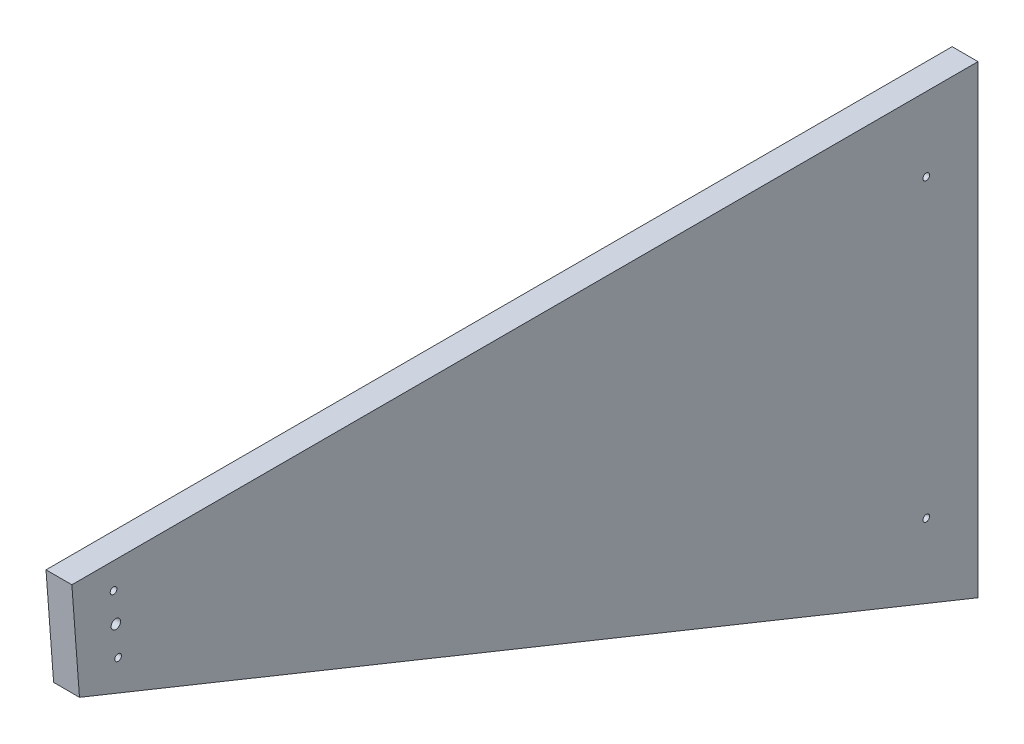
ISO-10303-21;
HEADER;
FILE_DESCRIPTION(('STEP AP214'),'2;1');
FILE_NAME('part.step','',(''),(''),'','','');
FILE_SCHEMA(('AUTOMOTIVE_DESIGN { 1 0 10303 214 1 1 1 1 }'));
ENDSEC;
DATA;
#1=APPLICATION_CONTEXT('core data for automotive mechanical design processes');
#2=APPLICATION_PROTOCOL_DEFINITION('international standard','automotive_design',2000,#1);
#3=PRODUCT_CONTEXT('',#1,'mechanical');
#4=PRODUCT('Part','Part','',(#3));
#5=PRODUCT_RELATED_PRODUCT_CATEGORY('part','',(#4));
#6=PRODUCT_DEFINITION_FORMATION('','',#4);
#7=PRODUCT_DEFINITION_CONTEXT('part definition',#1,'design');
#8=PRODUCT_DEFINITION('design','',#6,#7);
#9=PRODUCT_DEFINITION_SHAPE('','',#8);
#10=(LENGTH_UNIT() NAMED_UNIT(*) SI_UNIT(.MILLI.,.METRE.));
#11=(NAMED_UNIT(*) PLANE_ANGLE_UNIT() SI_UNIT($,.RADIAN.));
#12=(NAMED_UNIT(*) SI_UNIT($,.STERADIAN.) SOLID_ANGLE_UNIT());
#13=UNCERTAINTY_MEASURE_WITH_UNIT(LENGTH_MEASURE(1.E-05),#10,'distance_accuracy_value','');
#14=(GEOMETRIC_REPRESENTATION_CONTEXT(3) GLOBAL_UNCERTAINTY_ASSIGNED_CONTEXT((#13)) GLOBAL_UNIT_ASSIGNED_CONTEXT((#10,
#11,#12)) REPRESENTATION_CONTEXT('',''));
#15=CARTESIAN_POINT('',(0.,0.,0.));
#16=DIRECTION('',(0.,0.,1.));
#17=DIRECTION('',(1.,0.,0.));
#18=AXIS2_PLACEMENT_3D('',#15,#16,#17);
#19=CARTESIAN_POINT('',(285.75,6812.73593849404,3017.19500052054));
#20=DIRECTION('',(1.,-1.19356260075187E-13,0.));
#21=DIRECTION('',(1.19356260075187E-13,1.,0.));
#22=AXIS2_PLACEMENT_3D('',#19,#20,#21);
#23=PLANE('',#22);
#24=CARTESIAN_POINT('',(285.750000000057,6964.61767983907,3320.17307254985));
#25=DIRECTION('',(-1.,0.,0.));
#26=DIRECTION('',(0.,0.,1.));
#27=AXIS2_PLACEMENT_3D('',#24,#25,#26);
#28=CIRCLE('',#27,2.45744999999964);
#29=CARTESIAN_POINT('',(285.750000000057,6964.61767983907,3322.63052254985));
#30=VERTEX_POINT('',#29);
#31=EDGE_CURVE('E147',#30,#30,#28,.T.);
#32=ORIENTED_EDGE('',*,*,#31,.T.);
#33=EDGE_LOOP('',(#32));
#34=FACE_BOUND('',#33,.T.);
#35=CARTESIAN_POINT('',(285.750000000053,6920.29230044106,3316.84692745016));
#36=DIRECTION('',(-1.,0.,0.));
#37=DIRECTION('',(0.,0.,1.));
#38=AXIS2_PLACEMENT_3D('',#35,#36,#37);
#39=CIRCLE('',#38,2.45744999999964);
#40=CARTESIAN_POINT('',(285.750000000052,6920.29230044106,3319.30437745015));
#41=VERTEX_POINT('',#40);
#42=EDGE_CURVE('E138',#41,#41,#39,.T.);
#43=ORIENTED_EDGE('',*,*,#42,.T.);
#44=EDGE_LOOP('',(#43));
#45=FACE_BOUND('',#44,.T.);
#46=CARTESIAN_POINT('',(285.750000000023,6929.29753945556,2721.6100000542));
#47=DIRECTION('',(1.,-1.19356260075187E-13,0.));
#48=DIRECTION('',(1.19356260075187E-13,1.,0.));
#49=AXIS2_PLACEMENT_3D('',#46,#47,#48);
#50=CIRCLE('',#49,2.45744999999964);
#51=CARTESIAN_POINT('',(285.750000000023,6931.75498945556,2721.6100000542));
#52=VERTEX_POINT('',#51);
#53=EDGE_CURVE('E129',#52,#52,#50,.T.);
#54=ORIENTED_EDGE('',*,*,#53,.F.);
#55=EDGE_LOOP('',(#54));
#56=FACE_BOUND('',#55,.T.);
#57=CARTESIAN_POINT('',(285.749999999997,6711.56773671743,2721.6100000542));
#58=DIRECTION('',(1.,-1.19356260075187E-13,0.));
#59=DIRECTION('',(1.19356260075187E-13,1.,0.));
#60=AXIS2_PLACEMENT_3D('',#57,#58,#59);
#61=CIRCLE('',#60,2.45744999999964);
#62=CARTESIAN_POINT('',(285.749999999997,6714.02518671743,2721.6100000542));
#63=VERTEX_POINT('',#62);
#64=EDGE_CURVE('E95',#63,#63,#61,.T.);
#65=ORIENTED_EDGE('',*,*,#64,.F.);
#66=EDGE_LOOP('',(#65));
#67=FACE_BOUND('',#66,.T.);
#68=CARTESIAN_POINT('',(285.750000000008,6942.45499014005,3318.51));
#69=DIRECTION('',(-1.,1.19356260075173E-13,0.));
#70=DIRECTION('',(-1.19356260075173E-13,-1.,0.));
#71=AXIS2_PLACEMENT_3D('',#68,#69,#70);
#72=CIRCLE('',#71,3.49249999999985);
#73=CARTESIAN_POINT('',(285.750000000008,6938.96249014005,3318.51));
#74=VERTEX_POINT('',#73);
#75=EDGE_CURVE('E47',#74,#74,#72,.T.);
#76=ORIENTED_EDGE('',*,*,#75,.T.);
#77=EDGE_LOOP('',(#76));
#78=FACE_BOUND('',#77,.T.);
#79=DIRECTION('',(0.,1.,0.));
#80=VECTOR('',#79,1.);
#81=CARTESIAN_POINT('',(285.750000000038,6641.741886848,2683.51));
#82=LINE('',#81,#80);
#83=CARTESIAN_POINT('',(285.750000000022,6983.72999014007,2683.51));
#84=VERTEX_POINT('',#83);
#85=CARTESIAN_POINT('',(285.750000000017,6641.741886848,2683.51));
#86=VERTEX_POINT('',#85);
#87=EDGE_CURVE('E97',#84,#86,#82,.F.);
#88=ORIENTED_EDGE('',*,*,#87,.F.);
#89=DIRECTION('',(0.,0.,1.));
#90=VECTOR('',#89,1.);
#91=CARTESIAN_POINT('',(285.75000000001,6983.72999014007,2683.51));
#92=LINE('',#91,#90);
#93=CARTESIAN_POINT('',(285.750000000006,6983.72999014005,3350.88000104103));
#94=VERTEX_POINT('',#93);
#95=EDGE_CURVE('E81',#94,#84,#92,.F.);
#96=ORIENTED_EDGE('',*,*,#95,.F.);
#97=DIRECTION('',(0.,-0.997196386906744,-0.0748289111248876));
#98=VECTOR('',#97,1.);
#99=CARTESIAN_POINT('',(285.750000000003,6983.72999014005,3350.88000104107));
#100=LINE('',#99,#98);
#101=CARTESIAN_POINT('',(285.750000000002,6909.11469486814,3345.28092209157));
#102=VERTEX_POINT('',#101);
#103=EDGE_CURVE('E86',#102,#94,#100,.F.);
#104=ORIENTED_EDGE('',*,*,#103,.F.);
#105=DIRECTION('',(0.,-0.37460659341596,-0.927183854566768));
#106=VECTOR('',#105,1.);
#107=CARTESIAN_POINT('',(285.750000000003,6909.11469486814,3345.28092209158));
#108=LINE('',#107,#106);
#109=EDGE_CURVE('E110',#86,#102,#108,.F.);
#110=ORIENTED_EDGE('',*,*,#109,.F.);
#111=EDGE_LOOP('',(#88,#96,#104,#110));
#112=FACE_BOUND('',#111,.T.);
#113=ADVANCED_FACE('F44',(#34,#45,#56,#67,#78,#112),#23,.T.);
#114=CARTESIAN_POINT('',(266.70000000001,6983.72999014005,3350.88000104107));
#115=DIRECTION('',(0.,-0.0748289111248876,0.997196386906744));
#116=DIRECTION('',(0.,-0.997196386906744,-0.0748289111248876));
#117=AXIS2_PLACEMENT_3D('',#114,#115,#116);
#118=PLANE('',#117);
#119=ORIENTED_EDGE('',*,*,#103,.T.);
#120=DIRECTION('',(-1.,1.19356260075187E-13,0.));
#121=VECTOR('',#120,1.);
#122=CARTESIAN_POINT('',(266.700000000038,6983.72999014007,3350.880001041));
#123=LINE('',#122,#121);
#124=CARTESIAN_POINT('',(266.700000000017,6983.72999014006,3350.88000104103));
#125=VERTEX_POINT('',#124);
#126=EDGE_CURVE('E88',#125,#94,#123,.F.);
#127=ORIENTED_EDGE('',*,*,#126,.F.);
#128=DIRECTION('',(0.,0.997196386906838,0.074828911123633));
#129=VECTOR('',#128,1.);
#130=CARTESIAN_POINT('',(266.700000000001,6909.11469486815,3345.28092209158));
#131=LINE('',#130,#129);
#132=CARTESIAN_POINT('',(266.700000000006,6909.11469486815,3345.28092209157));
#133=VERTEX_POINT('',#132);
#134=EDGE_CURVE('E113',#133,#125,#131,.T.);
#135=ORIENTED_EDGE('',*,*,#134,.F.);
#136=DIRECTION('',(1.,-1.12970962324406E-13,0.));
#137=VECTOR('',#136,1.);
#138=CARTESIAN_POINT('',(266.700000000002,6909.11469486815,3345.28092209158));
#139=LINE('',#138,#137);
#140=EDGE_CURVE('E91',#102,#133,#139,.F.);
#141=ORIENTED_EDGE('',*,*,#140,.F.);
#142=EDGE_LOOP('',(#119,#127,#135,#141));
#143=FACE_BOUND('',#142,.T.);
#144=ADVANCED_FACE('F87',(#143),#118,.T.);
#145=CARTESIAN_POINT('',(266.700000000038,6983.72999014007,2683.51));
#146=DIRECTION('',(1.19356260075187E-13,1.,0.));
#147=DIRECTION('',(-1.,1.19356260075187E-13,0.));
#148=AXIS2_PLACEMENT_3D('',#145,#146,#147);
#149=PLANE('',#148);
#150=ORIENTED_EDGE('',*,*,#95,.T.);
#151=DIRECTION('',(-1.,0.,0.));
#152=VECTOR('',#151,1.);
#153=CARTESIAN_POINT('',(266.700000000002,6983.72999014007,2683.51));
#154=LINE('',#153,#152);
#155=CARTESIAN_POINT('',(266.700000000029,6983.72999014007,2683.51));
#156=VERTEX_POINT('',#155);
#157=EDGE_CURVE('E99',#156,#84,#154,.F.);
#158=ORIENTED_EDGE('',*,*,#157,.F.);
#159=DIRECTION('',(0.,0.,1.));
#160=VECTOR('',#159,1.);
#161=CARTESIAN_POINT('',(266.700000000023,6983.72999014007,3017.19500052054));
#162=LINE('',#161,#160);
#163=EDGE_CURVE('E103',#125,#156,#162,.F.);
#164=ORIENTED_EDGE('',*,*,#163,.F.);
#165=ORIENTED_EDGE('',*,*,#126,.T.);
#166=EDGE_LOOP('',(#150,#158,#164,#165));
#167=FACE_BOUND('',#166,.T.);
#168=ADVANCED_FACE('F101',(#167),#149,.T.);
#169=CARTESIAN_POINT('',(266.700000000002,6641.741886848,2683.51));
#170=DIRECTION('',(0.,0.,-1.));
#171=DIRECTION('',(-1.,0.,0.));
#172=AXIS2_PLACEMENT_3D('',#169,#170,#171);
#173=PLANE('',#172);
#174=ORIENTED_EDGE('',*,*,#87,.T.);
#175=DIRECTION('',(1.,-1.12970962324406E-13,0.));
#176=VECTOR('',#175,1.);
#177=CARTESIAN_POINT('',(266.700000000002,6641.74188684799,2683.51));
#178=LINE('',#177,#176);
#179=CARTESIAN_POINT('',(266.700000000002,6641.741886848,2683.51));
#180=VERTEX_POINT('',#179);
#181=EDGE_CURVE('E61',#180,#86,#178,.T.);
#182=ORIENTED_EDGE('',*,*,#181,.F.);
#183=DIRECTION('',(-1.03707897588097E-13,-1.,0.));
#184=VECTOR('',#183,1.);
#185=CARTESIAN_POINT('',(266.700000000019,6812.73593849404,2683.51));
#186=LINE('',#185,#184);
#187=EDGE_CURVE('E116',#156,#180,#186,.T.);
#188=ORIENTED_EDGE('',*,*,#187,.F.);
#189=ORIENTED_EDGE('',*,*,#157,.T.);
#190=EDGE_LOOP('',(#174,#182,#188,#189));
#191=FACE_BOUND('',#190,.T.);
#192=ADVANCED_FACE('F173',(#191),#173,.T.);
#193=CARTESIAN_POINT('',(266.700000000002,6909.11469486815,3345.28092209158));
#194=DIRECTION('',(-1.21843107780595E-13,-0.927183854566768,0.37460659341596));
#195=DIRECTION('',(0.,-0.37460659341596,-0.927183854566768));
#196=AXIS2_PLACEMENT_3D('',#193,#194,#195);
#197=PLANE('',#196);
#198=ORIENTED_EDGE('',*,*,#109,.T.);
#199=ORIENTED_EDGE('',*,*,#140,.T.);
#200=DIRECTION('',(0.,0.374606593415949,0.927183854566772));
#201=VECTOR('',#200,1.);
#202=CARTESIAN_POINT('',(266.700000000001,6641.741886848,2683.51));
#203=LINE('',#202,#201);
#204=EDGE_CURVE('E53',#180,#133,#203,.T.);
#205=ORIENTED_EDGE('',*,*,#204,.F.);
#206=ORIENTED_EDGE('',*,*,#181,.T.);
#207=EDGE_LOOP('',(#198,#199,#205,#206));
#208=FACE_BOUND('',#207,.T.);
#209=ADVANCED_FACE('F175',(#208),#197,.T.);
#210=CARTESIAN_POINT('',(285.750000000008,6942.45499014005,3318.51));
#211=DIRECTION('',(-1.,1.19356260075173E-13,0.));
#212=DIRECTION('',(-1.19356260075173E-13,-1.,0.));
#213=AXIS2_PLACEMENT_3D('',#210,#211,#212);
#214=CYLINDRICAL_SURFACE('',#213,3.49249999999985);
#215=ORIENTED_EDGE('',*,*,#75,.F.);
#216=EDGE_LOOP('',(#215));
#217=FACE_BOUND('',#216,.T.);
#218=CARTESIAN_POINT('',(266.700000000013,6942.45499014005,3318.51));
#219=DIRECTION('',(-1.,1.19356260075173E-13,0.));
#220=DIRECTION('',(-1.19356260075173E-13,-1.,0.));
#221=AXIS2_PLACEMENT_3D('',#218,#219,#220);
#222=CIRCLE('',#221,3.49249999999985);
#223=CARTESIAN_POINT('',(266.700000000013,6938.96249014005,3318.51));
#224=VERTEX_POINT('',#223);
#225=EDGE_CURVE('E11',#224,#224,#222,.F.);
#226=ORIENTED_EDGE('',*,*,#225,.F.);
#227=EDGE_LOOP('',(#226));
#228=FACE_BOUND('',#227,.T.);
#229=ADVANCED_FACE('F163',(#217,#228),#214,.F.);
#230=CARTESIAN_POINT('',(266.700000000005,6812.73593849404,3017.19500052054));
#231=DIRECTION('',(-1.,1.03707897588097E-13,0.));
#232=DIRECTION('',(-1.03707897588097E-13,-1.,0.));
#233=AXIS2_PLACEMENT_3D('',#230,#231,#232);
#234=PLANE('',#233);
#235=CARTESIAN_POINT('',(266.700000000008,6964.61767983907,3320.17307254984));
#236=DIRECTION('',(-1.,0.,0.));
#237=DIRECTION('',(0.,0.,1.));
#238=AXIS2_PLACEMENT_3D('',#235,#236,#237);
#239=CIRCLE('',#238,4.21639999999979);
#240=CARTESIAN_POINT('',(266.700000000008,6964.61767983907,3324.38947254984));
#241=VERTEX_POINT('',#240);
#242=EDGE_CURVE('E153',#241,#241,#239,.T.);
#243=ORIENTED_EDGE('',*,*,#242,.F.);
#244=EDGE_LOOP('',(#243));
#245=FACE_BOUND('',#244,.T.);
#246=CARTESIAN_POINT('',(266.700000000004,6920.29230044106,3316.84692745015));
#247=DIRECTION('',(-1.,0.,0.));
#248=DIRECTION('',(0.,0.,1.));
#249=AXIS2_PLACEMENT_3D('',#246,#247,#248);
#250=CIRCLE('',#249,4.21639999999979);
#251=CARTESIAN_POINT('',(266.700000000004,6920.29230044106,3321.06332745015));
#252=VERTEX_POINT('',#251);
#253=EDGE_CURVE('E144',#252,#252,#250,.T.);
#254=ORIENTED_EDGE('',*,*,#253,.F.);
#255=EDGE_LOOP('',(#254));
#256=FACE_BOUND('',#255,.T.);
#257=CARTESIAN_POINT('',(266.70000000003,6929.29753945556,2721.6100000542));
#258=DIRECTION('',(-1.,0.,0.));
#259=DIRECTION('',(0.,0.,1.));
#260=AXIS2_PLACEMENT_3D('',#257,#258,#259);
#261=CIRCLE('',#260,4.21639999999979);
#262=CARTESIAN_POINT('',(266.700000000029,6929.29753945556,2725.8264000542));
#263=VERTEX_POINT('',#262);
#264=EDGE_CURVE('E135',#263,#263,#261,.T.);
#265=ORIENTED_EDGE('',*,*,#264,.F.);
#266=EDGE_LOOP('',(#265));
#267=FACE_BOUND('',#266,.T.);
#268=CARTESIAN_POINT('',(266.700000000007,6711.56773671743,2721.6100000542));
#269=DIRECTION('',(-1.,0.,0.));
#270=DIRECTION('',(0.,0.,1.));
#271=AXIS2_PLACEMENT_3D('',#268,#269,#270);
#272=CIRCLE('',#271,4.21639999999979);
#273=CARTESIAN_POINT('',(266.700000000007,6711.56773671743,2725.8264000542));
#274=VERTEX_POINT('',#273);
#275=EDGE_CURVE('E126',#274,#274,#272,.T.);
#276=ORIENTED_EDGE('',*,*,#275,.F.);
#277=EDGE_LOOP('',(#276));
#278=FACE_BOUND('',#277,.T.);
#279=ORIENTED_EDGE('',*,*,#225,.T.);
#280=EDGE_LOOP('',(#279));
#281=FACE_BOUND('',#280,.T.);
#282=ORIENTED_EDGE('',*,*,#187,.T.);
#283=ORIENTED_EDGE('',*,*,#204,.T.);
#284=ORIENTED_EDGE('',*,*,#134,.T.);
#285=ORIENTED_EDGE('',*,*,#163,.T.);
#286=EDGE_LOOP('',(#282,#283,#284,#285));
#287=FACE_BOUND('',#286,.T.);
#288=ADVANCED_FACE('F159',(#245,#256,#267,#278,#281,#287),#234,.T.);
#289=CARTESIAN_POINT('',(266.700000000007,6711.56773671743,2721.6100000542));
#290=DIRECTION('',(-1.,0.,0.));
#291=DIRECTION('',(0.,0.,1.));
#292=AXIS2_PLACEMENT_3D('',#289,#290,#291);
#293=CYLINDRICAL_SURFACE('',#292,2.45744999999964);
#294=CARTESIAN_POINT('',(268.175934296266,6711.56773671743,2721.6100000542));
#295=DIRECTION('',(-1.,0.,0.));
#296=DIRECTION('',(0.,0.,1.));
#297=AXIS2_PLACEMENT_3D('',#294,#295,#296);
#298=CIRCLE('',#297,2.45744999999964);
#299=CARTESIAN_POINT('',(268.175934296266,6711.56773671743,2724.0674500542));
#300=VERTEX_POINT('',#299);
#301=EDGE_CURVE('E123',#300,#300,#298,.T.);
#302=ORIENTED_EDGE('',*,*,#301,.T.);
#303=EDGE_LOOP('',(#302));
#304=FACE_BOUND('',#303,.T.);
#305=ORIENTED_EDGE('',*,*,#64,.T.);
#306=EDGE_LOOP('',(#305));
#307=FACE_BOUND('',#306,.T.);
#308=ADVANCED_FACE('F162',(#304,#307),#293,.F.);
#309=CARTESIAN_POINT('',(266.700000000007,6711.56773671743,2721.6100000542));
#310=DIRECTION('',(-1.,0.,0.));
#311=DIRECTION('',(0.,0.,1.));
#312=AXIS2_PLACEMENT_3D('',#309,#310,#311);
#313=CONICAL_SURFACE('',#312,4.21639999999979,0.872664625997215);
#314=ORIENTED_EDGE('',*,*,#301,.F.);
#315=EDGE_LOOP('',(#314));
#316=FACE_BOUND('',#315,.T.);
#317=ORIENTED_EDGE('',*,*,#275,.T.);
#318=EDGE_LOOP('',(#317));
#319=FACE_BOUND('',#318,.T.);
#320=ADVANCED_FACE('F196',(#316,#319),#313,.F.);
#321=CARTESIAN_POINT('',(266.70000000003,6929.29753945556,2721.6100000542));
#322=DIRECTION('',(-1.,0.,0.));
#323=DIRECTION('',(0.,0.,1.));
#324=AXIS2_PLACEMENT_3D('',#321,#322,#323);
#325=CYLINDRICAL_SURFACE('',#324,2.45744999999964);
#326=CARTESIAN_POINT('',(268.175934296289,6929.29753945556,2721.6100000542));
#327=DIRECTION('',(-1.,0.,0.));
#328=DIRECTION('',(0.,0.,1.));
#329=AXIS2_PLACEMENT_3D('',#326,#327,#328);
#330=CIRCLE('',#329,2.45744999999964);
#331=CARTESIAN_POINT('',(268.175934296289,6929.29753945556,2724.0674500542));
#332=VERTEX_POINT('',#331);
#333=EDGE_CURVE('E132',#332,#332,#330,.T.);
#334=ORIENTED_EDGE('',*,*,#333,.T.);
#335=EDGE_LOOP('',(#334));
#336=FACE_BOUND('',#335,.T.);
#337=ORIENTED_EDGE('',*,*,#53,.T.);
#338=EDGE_LOOP('',(#337));
#339=FACE_BOUND('',#338,.T.);
#340=ADVANCED_FACE('F202',(#336,#339),#325,.F.);
#341=CARTESIAN_POINT('',(266.70000000003,6929.29753945556,2721.6100000542));
#342=DIRECTION('',(-1.,0.,0.));
#343=DIRECTION('',(0.,0.,1.));
#344=AXIS2_PLACEMENT_3D('',#341,#342,#343);
#345=CONICAL_SURFACE('',#344,4.21639999999979,0.872664625997215);
#346=ORIENTED_EDGE('',*,*,#333,.F.);
#347=EDGE_LOOP('',(#346));
#348=FACE_BOUND('',#347,.T.);
#349=ORIENTED_EDGE('',*,*,#264,.T.);
#350=EDGE_LOOP('',(#349));
#351=FACE_BOUND('',#350,.T.);
#352=ADVANCED_FACE('F209',(#348,#351),#345,.F.);
#353=CARTESIAN_POINT('',(266.700000000004,6920.29230044106,3316.84692745015));
#354=DIRECTION('',(-1.,0.,0.));
#355=DIRECTION('',(0.,0.,1.));
#356=AXIS2_PLACEMENT_3D('',#353,#354,#355);
#357=CYLINDRICAL_SURFACE('',#356,2.45744999999964);
#358=ORIENTED_EDGE('',*,*,#42,.F.);
#359=EDGE_LOOP('',(#358));
#360=FACE_BOUND('',#359,.T.);
#361=CARTESIAN_POINT('',(268.175934296263,6920.29230044106,3316.84692745015));
#362=DIRECTION('',(-1.,0.,0.));
#363=DIRECTION('',(0.,0.,1.));
#364=AXIS2_PLACEMENT_3D('',#361,#362,#363);
#365=CIRCLE('',#364,2.45744999999964);
#366=CARTESIAN_POINT('',(268.175934296263,6920.29230044106,3319.30437745015));
#367=VERTEX_POINT('',#366);
#368=EDGE_CURVE('E141',#367,#367,#365,.T.);
#369=ORIENTED_EDGE('',*,*,#368,.T.);
#370=EDGE_LOOP('',(#369));
#371=FACE_BOUND('',#370,.T.);
#372=ADVANCED_FACE('F213',(#360,#371),#357,.F.);
#373=CARTESIAN_POINT('',(266.700000000004,6920.29230044106,3316.84692745015));
#374=DIRECTION('',(-1.,0.,0.));
#375=DIRECTION('',(0.,0.,1.));
#376=AXIS2_PLACEMENT_3D('',#373,#374,#375);
#377=CONICAL_SURFACE('',#376,4.21639999999979,0.872664625997196);
#378=ORIENTED_EDGE('',*,*,#368,.F.);
#379=EDGE_LOOP('',(#378));
#380=FACE_BOUND('',#379,.T.);
#381=ORIENTED_EDGE('',*,*,#253,.T.);
#382=EDGE_LOOP('',(#381));
#383=FACE_BOUND('',#382,.T.);
#384=ADVANCED_FACE('F217',(#380,#383),#377,.F.);
#385=CARTESIAN_POINT('',(266.700000000008,6964.61767983907,3320.17307254984));
#386=DIRECTION('',(-1.,0.,0.));
#387=DIRECTION('',(0.,0.,1.));
#388=AXIS2_PLACEMENT_3D('',#385,#386,#387);
#389=CYLINDRICAL_SURFACE('',#388,2.45744999999964);
#390=ORIENTED_EDGE('',*,*,#31,.F.);
#391=EDGE_LOOP('',(#390));
#392=FACE_BOUND('',#391,.T.);
#393=CARTESIAN_POINT('',(268.175934296267,6964.61767983907,3320.17307254984));
#394=DIRECTION('',(-1.,0.,0.));
#395=DIRECTION('',(0.,0.,1.));
#396=AXIS2_PLACEMENT_3D('',#393,#394,#395);
#397=CIRCLE('',#396,2.45744999999964);
#398=CARTESIAN_POINT('',(268.175934296267,6964.61767983907,3322.63052254984));
#399=VERTEX_POINT('',#398);
#400=EDGE_CURVE('E150',#399,#399,#397,.T.);
#401=ORIENTED_EDGE('',*,*,#400,.T.);
#402=EDGE_LOOP('',(#401));
#403=FACE_BOUND('',#402,.T.);
#404=ADVANCED_FACE('F221',(#392,#403),#389,.F.);
#405=CARTESIAN_POINT('',(266.700000000008,6964.61767983907,3320.17307254984));
#406=DIRECTION('',(-1.,0.,0.));
#407=DIRECTION('',(0.,0.,1.));
#408=AXIS2_PLACEMENT_3D('',#405,#406,#407);
#409=CONICAL_SURFACE('',#408,4.21639999999979,0.872664625997196);
#410=ORIENTED_EDGE('',*,*,#400,.F.);
#411=EDGE_LOOP('',(#410));
#412=FACE_BOUND('',#411,.T.);
#413=ORIENTED_EDGE('',*,*,#242,.T.);
#414=EDGE_LOOP('',(#413));
#415=FACE_BOUND('',#414,.T.);
#416=ADVANCED_FACE('F157',(#412,#415),#409,.F.);
#417=CLOSED_SHELL('',(#113,#144,#168,#192,#209,#229,#288,#308,#320,#340,#352,#372,#384,#404,#416));
#418=MANIFOLD_SOLID_BREP('B2',#417);
#419=ADVANCED_BREP_SHAPE_REPRESENTATION('',(#18,#418),#14);
#420=SHAPE_DEFINITION_REPRESENTATION(#9,#419);
ENDSEC;
END-ISO-10303-21;
